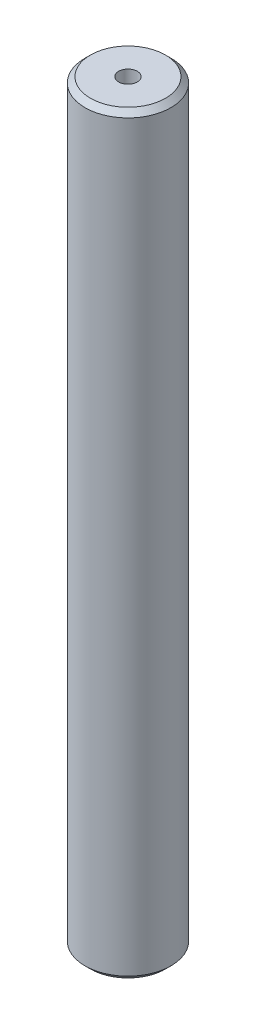
ISO-10303-21;
HEADER;
FILE_DESCRIPTION(('STEP AP214'),'2;1');
FILE_NAME('part.step','',(''),(''),'','','');
FILE_SCHEMA(('AUTOMOTIVE_DESIGN { 1 0 10303 214 1 1 1 1 }'));
ENDSEC;
DATA;
#1=APPLICATION_CONTEXT('core data for automotive mechanical design processes');
#2=APPLICATION_PROTOCOL_DEFINITION('international standard','automotive_design',2000,#1);
#3=PRODUCT_CONTEXT('',#1,'mechanical');
#4=PRODUCT('Part','Part','',(#3));
#5=PRODUCT_RELATED_PRODUCT_CATEGORY('part','',(#4));
#6=PRODUCT_DEFINITION_FORMATION('','',#4);
#7=PRODUCT_DEFINITION_CONTEXT('part definition',#1,'design');
#8=PRODUCT_DEFINITION('design','',#6,#7);
#9=PRODUCT_DEFINITION_SHAPE('','',#8);
#10=(LENGTH_UNIT() NAMED_UNIT(*) SI_UNIT(.MILLI.,.METRE.));
#11=(NAMED_UNIT(*) PLANE_ANGLE_UNIT() SI_UNIT($,.RADIAN.));
#12=(NAMED_UNIT(*) SI_UNIT($,.STERADIAN.) SOLID_ANGLE_UNIT());
#13=UNCERTAINTY_MEASURE_WITH_UNIT(LENGTH_MEASURE(1.E-05),#10,'distance_accuracy_value','');
#14=(GEOMETRIC_REPRESENTATION_CONTEXT(3) GLOBAL_UNCERTAINTY_ASSIGNED_CONTEXT((#13)) GLOBAL_UNIT_ASSIGNED_CONTEXT((#10,
#11,#12)) REPRESENTATION_CONTEXT('',''));
#15=CARTESIAN_POINT('',(0.,0.,0.));
#16=DIRECTION('',(0.,0.,1.));
#17=DIRECTION('',(1.,0.,0.));
#18=AXIS2_PLACEMENT_3D('',#15,#16,#17);
#19=CARTESIAN_POINT('',(0.,87.8103624064283,0.));
#20=DIRECTION('',(0.,-1.,0.));
#21=DIRECTION('',(0.,0.,-1.));
#22=AXIS2_PLACEMENT_3D('',#19,#20,#21);
#23=CYLINDRICAL_SURFACE('',#22,5.);
#24=CARTESIAN_POINT('',(0.,87.1785744538004,0.));
#25=DIRECTION('',(0.,1.,0.));
#26=DIRECTION('',(0.,0.,1.));
#27=AXIS2_PLACEMENT_3D('',#24,#25,#26);
#28=CIRCLE('',#27,5.);
#29=CARTESIAN_POINT('',(0.,87.1785744538004,5.));
#30=VERTEX_POINT('',#29);
#31=EDGE_CURVE('E50',#30,#30,#28,.F.);
#32=ORIENTED_EDGE('',*,*,#31,.T.);
#33=EDGE_LOOP('',(#32));
#34=FACE_BOUND('',#33,.T.);
#35=CARTESIAN_POINT('',(0.,0.631787952627874,0.));
#36=DIRECTION('',(0.,1.,0.));
#37=DIRECTION('',(0.,0.,1.));
#38=AXIS2_PLACEMENT_3D('',#35,#36,#37);
#39=CIRCLE('',#38,5.);
#40=CARTESIAN_POINT('',(0.,0.631787952627874,5.));
#41=VERTEX_POINT('',#40);
#42=EDGE_CURVE('E51',#41,#41,#39,.T.);
#43=ORIENTED_EDGE('',*,*,#42,.T.);
#44=EDGE_LOOP('',(#43));
#45=FACE_BOUND('',#44,.T.);
#46=ADVANCED_FACE('F39',(#34,#45),#23,.T.);
#47=CARTESIAN_POINT('',(0.,87.8103624064283,0.));
#48=DIRECTION('',(0.,1.,0.));
#49=DIRECTION('',(0.,0.,1.));
#50=AXIS2_PLACEMENT_3D('',#47,#48,#49);
#51=PLANE('',#50);
#52=CARTESIAN_POINT('',(0.,87.8103624064283,0.));
#53=DIRECTION('',(0.,1.,0.));
#54=DIRECTION('',(0.,0.,1.));
#55=AXIS2_PLACEMENT_3D('',#52,#53,#54);
#56=CIRCLE('',#55,4.3682120473721);
#57=CARTESIAN_POINT('',(0.,87.8103624064283,4.3682120473721));
#58=VERTEX_POINT('',#57);
#59=EDGE_CURVE('E54',#58,#58,#56,.T.);
#60=ORIENTED_EDGE('',*,*,#59,.T.);
#61=EDGE_LOOP('',(#60));
#62=FACE_BOUND('',#61,.T.);
#63=CARTESIAN_POINT('',(0.,87.8103624064283,0.));
#64=DIRECTION('',(0.,1.,0.));
#65=DIRECTION('',(0.,0.,1.));
#66=AXIS2_PLACEMENT_3D('',#63,#64,#65);
#67=CIRCLE('',#66,1.08479433905138);
#68=CARTESIAN_POINT('',(0.,87.8103624064283,1.08479433905138));
#69=VERTEX_POINT('',#68);
#70=EDGE_CURVE('E58',#69,#69,#67,.T.);
#71=ORIENTED_EDGE('',*,*,#70,.F.);
#72=EDGE_LOOP('',(#71));
#73=FACE_BOUND('',#72,.T.);
#74=ADVANCED_FACE('F69',(#62,#73),#51,.T.);
#75=CARTESIAN_POINT('',(0.,0.,0.));
#76=DIRECTION('',(0.,1.,0.));
#77=DIRECTION('',(0.,0.,1.));
#78=AXIS2_PLACEMENT_3D('',#75,#76,#77);
#79=PLANE('',#78);
#80=CARTESIAN_POINT('',(0.,0.,0.));
#81=DIRECTION('',(0.,1.,0.));
#82=DIRECTION('',(0.,0.,1.));
#83=AXIS2_PLACEMENT_3D('',#80,#81,#82);
#84=CIRCLE('',#83,4.36821204737212);
#85=CARTESIAN_POINT('',(0.,0.,4.36821204737212));
#86=VERTEX_POINT('',#85);
#87=EDGE_CURVE('E10',#86,#86,#84,.F.);
#88=ORIENTED_EDGE('',*,*,#87,.T.);
#89=EDGE_LOOP('',(#88));
#90=FACE_BOUND('',#89,.T.);
#91=CARTESIAN_POINT('',(0.,0.,0.));
#92=DIRECTION('',(0.,1.,0.));
#93=DIRECTION('',(0.,0.,1.));
#94=AXIS2_PLACEMENT_3D('',#91,#92,#93);
#95=CIRCLE('',#94,1.08479433905138);
#96=CARTESIAN_POINT('',(0.,0.,1.08479433905138));
#97=VERTEX_POINT('',#96);
#98=EDGE_CURVE('E63',#97,#97,#95,.T.);
#99=ORIENTED_EDGE('',*,*,#98,.T.);
#100=EDGE_LOOP('',(#99));
#101=FACE_BOUND('',#100,.T.);
#102=ADVANCED_FACE('F75',(#90,#101),#79,.F.);
#103=CARTESIAN_POINT('',(0.,87.8103624064283,0.));
#104=DIRECTION('',(0.,-1.,0.));
#105=DIRECTION('',(0.,0.,-1.));
#106=AXIS2_PLACEMENT_3D('',#103,#104,#105);
#107=CYLINDRICAL_SURFACE('',#106,1.08479433905138);
#108=ORIENTED_EDGE('',*,*,#70,.T.);
#109=EDGE_LOOP('',(#108));
#110=FACE_BOUND('',#109,.T.);
#111=ORIENTED_EDGE('',*,*,#98,.F.);
#112=EDGE_LOOP('',(#111));
#113=FACE_BOUND('',#112,.T.);
#114=ADVANCED_FACE('F70',(#110,#113),#107,.F.);
#115=CARTESIAN_POINT('',(0.,87.8103624064283,0.));
#116=DIRECTION('',(0.,-1.,0.));
#117=DIRECTION('',(0.,0.,-1.));
#118=AXIS2_PLACEMENT_3D('',#115,#116,#117);
#119=CONICAL_SURFACE('',#118,4.3682120473721,0.785398163397445);
#120=ORIENTED_EDGE('',*,*,#31,.F.);
#121=EDGE_LOOP('',(#120));
#122=FACE_BOUND('',#121,.T.);
#123=ORIENTED_EDGE('',*,*,#59,.F.);
#124=EDGE_LOOP('',(#123));
#125=FACE_BOUND('',#124,.T.);
#126=ADVANCED_FACE('F81',(#122,#125),#119,.T.);
#127=CARTESIAN_POINT('',(0.,0.631787952627874,0.));
#128=DIRECTION('',(0.,1.,0.));
#129=DIRECTION('',(0.,0.,1.));
#130=AXIS2_PLACEMENT_3D('',#127,#128,#129);
#131=CONICAL_SURFACE('',#130,5.,0.78539816339745);
#132=ORIENTED_EDGE('',*,*,#87,.F.);
#133=EDGE_LOOP('',(#132));
#134=FACE_BOUND('',#133,.T.);
#135=ORIENTED_EDGE('',*,*,#42,.F.);
#136=EDGE_LOOP('',(#135));
#137=FACE_BOUND('',#136,.T.);
#138=ADVANCED_FACE('F45',(#134,#137),#131,.T.);
#139=CLOSED_SHELL('',(#46,#74,#102,#114,#126,#138));
#140=MANIFOLD_SOLID_BREP('B2',#139);
#141=ADVANCED_BREP_SHAPE_REPRESENTATION('',(#18,#140),#14);
#142=SHAPE_DEFINITION_REPRESENTATION(#9,#141);
ENDSEC;
END-ISO-10303-21;
